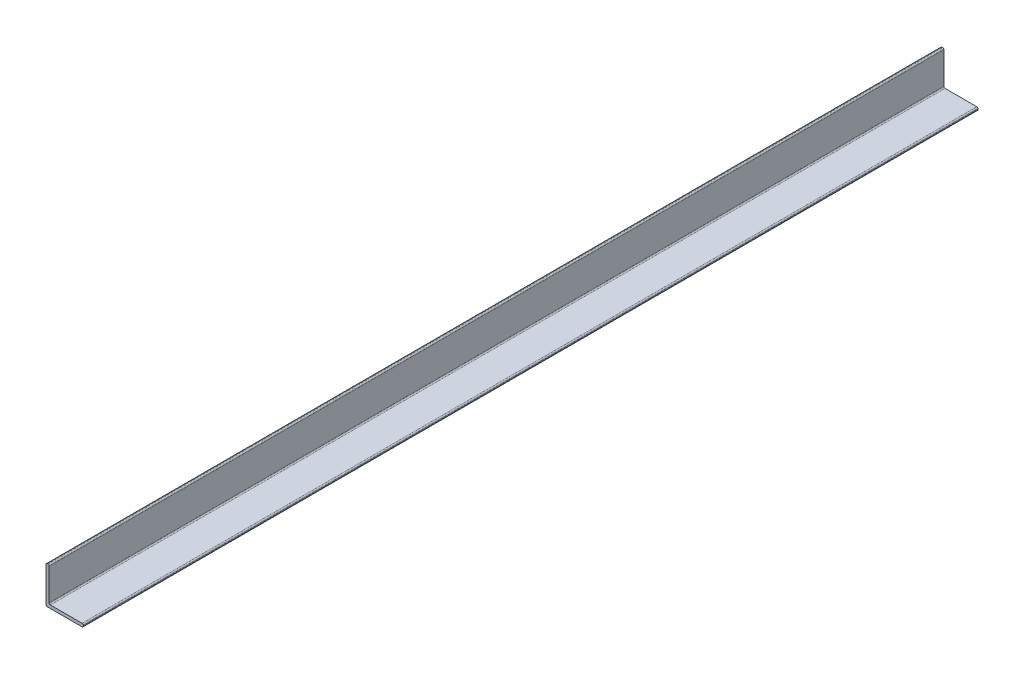
ISO-10303-21;
HEADER;
FILE_DESCRIPTION(('STEP AP214'),'2;1');
FILE_NAME('part.step','',(''),(''),'','','');
FILE_SCHEMA(('AUTOMOTIVE_DESIGN { 1 0 10303 214 1 1 1 1 }'));
ENDSEC;
DATA;
#1=APPLICATION_CONTEXT('core data for automotive mechanical design processes');
#2=APPLICATION_PROTOCOL_DEFINITION('international standard','automotive_design',2000,#1);
#3=PRODUCT_CONTEXT('',#1,'mechanical');
#4=PRODUCT('Part','Part','',(#3));
#5=PRODUCT_RELATED_PRODUCT_CATEGORY('part','',(#4));
#6=PRODUCT_DEFINITION_FORMATION('','',#4);
#7=PRODUCT_DEFINITION_CONTEXT('part definition',#1,'design');
#8=PRODUCT_DEFINITION('design','',#6,#7);
#9=PRODUCT_DEFINITION_SHAPE('','',#8);
#10=(LENGTH_UNIT() NAMED_UNIT(*) SI_UNIT(.MILLI.,.METRE.));
#11=(NAMED_UNIT(*) PLANE_ANGLE_UNIT() SI_UNIT($,.RADIAN.));
#12=(NAMED_UNIT(*) SI_UNIT($,.STERADIAN.) SOLID_ANGLE_UNIT());
#13=UNCERTAINTY_MEASURE_WITH_UNIT(LENGTH_MEASURE(1.E-05),#10,'distance_accuracy_value','');
#14=(GEOMETRIC_REPRESENTATION_CONTEXT(3) GLOBAL_UNCERTAINTY_ASSIGNED_CONTEXT((#13)) GLOBAL_UNIT_ASSIGNED_CONTEXT((#10,
#11,#12)) REPRESENTATION_CONTEXT('',''));
#15=CARTESIAN_POINT('',(0.,0.,0.));
#16=DIRECTION('',(0.,0.,1.));
#17=DIRECTION('',(1.,0.,0.));
#18=AXIS2_PLACEMENT_3D('',#15,#16,#17);
#19=CARTESIAN_POINT('',(-31.75,38.1,-914.4));
#20=DIRECTION('',(0.,1.,0.));
#21=DIRECTION('',(-1.,0.,0.));
#22=AXIS2_PLACEMENT_3D('',#19,#20,#21);
#23=PLANE('',#22);
#24=DIRECTION('',(-1.,0.,0.));
#25=VECTOR('',#24,1.);
#26=CARTESIAN_POINT('',(-31.75,38.1,-914.4));
#27=LINE('',#26,#25);
#28=CARTESIAN_POINT('',(-34.29,38.1,-914.4));
#29=VERTEX_POINT('',#28);
#30=CARTESIAN_POINT('',(-35.56,38.1,-914.4));
#31=VERTEX_POINT('',#30);
#32=EDGE_CURVE('E169',#29,#31,#27,.T.);
#33=ORIENTED_EDGE('',*,*,#32,.T.);
#34=DIRECTION('',(0.,0.,1.));
#35=VECTOR('',#34,1.);
#36=CARTESIAN_POINT('',(-35.56,38.1,-914.4));
#37=LINE('',#36,#35);
#38=CARTESIAN_POINT('',(-35.56,38.1,914.4));
#39=VERTEX_POINT('',#38);
#40=EDGE_CURVE('E54',#31,#39,#37,.T.);
#41=ORIENTED_EDGE('',*,*,#40,.T.);
#42=DIRECTION('',(-1.,0.,0.));
#43=VECTOR('',#42,1.);
#44=CARTESIAN_POINT('',(-31.75,38.1,914.4));
#45=LINE('',#44,#43);
#46=CARTESIAN_POINT('',(-34.29,38.1,914.4));
#47=VERTEX_POINT('',#46);
#48=EDGE_CURVE('E257',#47,#39,#45,.T.);
#49=ORIENTED_EDGE('',*,*,#48,.F.);
#50=DIRECTION('',(0.,0.,1.));
#51=VECTOR('',#50,1.);
#52=CARTESIAN_POINT('',(-34.29,38.1,-914.4));
#53=LINE('',#52,#51);
#54=EDGE_CURVE('E248',#47,#29,#53,.F.);
#55=ORIENTED_EDGE('',*,*,#54,.T.);
#56=EDGE_LOOP('',(#33,#41,#49,#55));
#57=FACE_BOUND('',#56,.T.);
#58=ADVANCED_FACE('F45',(#57),#23,.T.);
#59=CARTESIAN_POINT('',(-31.75,-29.21,-914.4));
#60=DIRECTION('',(1.,0.,0.));
#61=DIRECTION('',(0.,1.,0.));
#62=AXIS2_PLACEMENT_3D('',#59,#60,#61);
#63=PLANE('',#62);
#64=DIRECTION('',(0.,1.,0.));
#65=VECTOR('',#64,1.);
#66=CARTESIAN_POINT('',(-31.75,-29.21,-914.4));
#67=LINE('',#66,#65);
#68=CARTESIAN_POINT('',(-31.75,-29.21,-914.4));
#69=VERTEX_POINT('',#68);
#70=CARTESIAN_POINT('',(-31.75,35.56,-914.4));
#71=VERTEX_POINT('',#70);
#72=EDGE_CURVE('E161',#69,#71,#67,.T.);
#73=ORIENTED_EDGE('',*,*,#72,.T.);
#74=DIRECTION('',(0.,0.,1.));
#75=VECTOR('',#74,1.);
#76=CARTESIAN_POINT('',(-31.75,35.56,-914.4));
#77=LINE('',#76,#75);
#78=CARTESIAN_POINT('',(-31.75,35.56,914.4));
#79=VERTEX_POINT('',#78);
#80=EDGE_CURVE('E11',#71,#79,#77,.T.);
#81=ORIENTED_EDGE('',*,*,#80,.T.);
#82=DIRECTION('',(0.,1.,0.));
#83=VECTOR('',#82,1.);
#84=CARTESIAN_POINT('',(-31.75,-29.21,914.4));
#85=LINE('',#84,#83);
#86=CARTESIAN_POINT('',(-31.75,-29.21,914.4));
#87=VERTEX_POINT('',#86);
#88=EDGE_CURVE('E165',#87,#79,#85,.T.);
#89=ORIENTED_EDGE('',*,*,#88,.F.);
#90=DIRECTION('',(0.,0.,1.));
#91=VECTOR('',#90,1.);
#92=CARTESIAN_POINT('',(-31.75,-29.21,-914.4));
#93=LINE('',#92,#91);
#94=EDGE_CURVE('E160',#69,#87,#93,.T.);
#95=ORIENTED_EDGE('',*,*,#94,.F.);
#96=EDGE_LOOP('',(#73,#81,#89,#95));
#97=FACE_BOUND('',#96,.T.);
#98=ADVANCED_FACE('F301',(#97),#63,.T.);
#99=CARTESIAN_POINT('',(-29.21,-29.21,-914.4));
#100=DIRECTION('',(0.,0.,1.));
#101=DIRECTION('',(1.,0.,0.));
#102=AXIS2_PLACEMENT_3D('',#99,#100,#101);
#103=CYLINDRICAL_SURFACE('',#102,2.54);
#104=ORIENTED_EDGE('',*,*,#94,.T.);
#105=CARTESIAN_POINT('',(-29.21,-29.21,914.4));
#106=DIRECTION('',(0.,0.,-1.));
#107=DIRECTION('',(1.,0.,0.));
#108=AXIS2_PLACEMENT_3D('',#105,#106,#107);
#109=CIRCLE('',#108,2.54);
#110=CARTESIAN_POINT('',(-29.21,-31.75,914.4));
#111=VERTEX_POINT('',#110);
#112=EDGE_CURVE('E143',#111,#87,#109,.T.);
#113=ORIENTED_EDGE('',*,*,#112,.F.);
#114=DIRECTION('',(0.,0.,1.));
#115=VECTOR('',#114,1.);
#116=CARTESIAN_POINT('',(-29.21,-31.75,-914.4));
#117=LINE('',#116,#115);
#118=CARTESIAN_POINT('',(-29.21,-31.75,-914.4));
#119=VERTEX_POINT('',#118);
#120=EDGE_CURVE('E153',#119,#111,#117,.T.);
#121=ORIENTED_EDGE('',*,*,#120,.F.);
#122=CARTESIAN_POINT('',(-29.21,-29.21,-914.4));
#123=DIRECTION('',(0.,0.,-1.));
#124=DIRECTION('',(1.,0.,0.));
#125=AXIS2_PLACEMENT_3D('',#122,#123,#124);
#126=CIRCLE('',#125,2.54);
#127=EDGE_CURVE('E189',#119,#69,#126,.T.);
#128=ORIENTED_EDGE('',*,*,#127,.T.);
#129=EDGE_LOOP('',(#104,#113,#121,#128));
#130=FACE_BOUND('',#129,.T.);
#131=ADVANCED_FACE('F163',(#130),#103,.F.);
#132=CARTESIAN_POINT('',(38.1,-31.75,-914.4));
#133=DIRECTION('',(0.,1.,0.));
#134=DIRECTION('',(0.,0.,1.));
#135=AXIS2_PLACEMENT_3D('',#132,#133,#134);
#136=PLANE('',#135);
#137=DIRECTION('',(-1.,0.,0.));
#138=VECTOR('',#137,1.);
#139=CARTESIAN_POINT('',(38.1,-31.75,914.4));
#140=LINE('',#139,#138);
#141=CARTESIAN_POINT('',(35.56,-31.75,914.4));
#142=VERTEX_POINT('',#141);
#143=EDGE_CURVE('E137',#142,#111,#140,.T.);
#144=ORIENTED_EDGE('',*,*,#143,.F.);
#145=DIRECTION('',(0.,0.,1.));
#146=VECTOR('',#145,1.);
#147=CARTESIAN_POINT('',(35.56,-31.75,-914.4));
#148=LINE('',#147,#146);
#149=CARTESIAN_POINT('',(35.56,-31.75,-914.4));
#150=VERTEX_POINT('',#149);
#151=EDGE_CURVE('E245',#142,#150,#148,.F.);
#152=ORIENTED_EDGE('',*,*,#151,.T.);
#153=DIRECTION('',(-1.,0.,0.));
#154=VECTOR('',#153,1.);
#155=CARTESIAN_POINT('',(38.1,-31.75,-914.4));
#156=LINE('',#155,#154);
#157=EDGE_CURVE('E155',#150,#119,#156,.T.);
#158=ORIENTED_EDGE('',*,*,#157,.T.);
#159=ORIENTED_EDGE('',*,*,#120,.T.);
#160=EDGE_LOOP('',(#144,#152,#158,#159));
#161=FACE_BOUND('',#160,.T.);
#162=ADVANCED_FACE('F154',(#161),#136,.T.);
#163=CARTESIAN_POINT('',(38.1,-38.1,-914.4));
#164=DIRECTION('',(1.,0.,0.));
#165=DIRECTION('',(0.,1.,0.));
#166=AXIS2_PLACEMENT_3D('',#163,#164,#165);
#167=PLANE('',#166);
#168=DIRECTION('',(0.,1.,0.));
#169=VECTOR('',#168,1.);
#170=CARTESIAN_POINT('',(38.1,-38.1,914.4));
#171=LINE('',#170,#169);
#172=CARTESIAN_POINT('',(38.1,-35.56,914.4));
#173=VERTEX_POINT('',#172);
#174=CARTESIAN_POINT('',(38.1,-34.29,914.4));
#175=VERTEX_POINT('',#174);
#176=EDGE_CURVE('E150',#173,#175,#171,.T.);
#177=ORIENTED_EDGE('',*,*,#176,.F.);
#178=DIRECTION('',(0.,0.,1.));
#179=VECTOR('',#178,1.);
#180=CARTESIAN_POINT('',(38.1,-35.56,-914.4));
#181=LINE('',#180,#179);
#182=CARTESIAN_POINT('',(38.1,-35.56,-914.4));
#183=VERTEX_POINT('',#182);
#184=EDGE_CURVE('E68',#173,#183,#181,.F.);
#185=ORIENTED_EDGE('',*,*,#184,.T.);
#186=DIRECTION('',(0.,1.,0.));
#187=VECTOR('',#186,1.);
#188=CARTESIAN_POINT('',(38.1,-38.1,-914.4));
#189=LINE('',#188,#187);
#190=CARTESIAN_POINT('',(38.1,-34.29,-914.4));
#191=VERTEX_POINT('',#190);
#192=EDGE_CURVE('E184',#183,#191,#189,.T.);
#193=ORIENTED_EDGE('',*,*,#192,.T.);
#194=DIRECTION('',(0.,0.,1.));
#195=VECTOR('',#194,1.);
#196=CARTESIAN_POINT('',(38.1,-34.29,-914.4));
#197=LINE('',#196,#195);
#198=EDGE_CURVE('E239',#191,#175,#197,.T.);
#199=ORIENTED_EDGE('',*,*,#198,.T.);
#200=EDGE_LOOP('',(#177,#185,#193,#199));
#201=FACE_BOUND('',#200,.T.);
#202=ADVANCED_FACE('F275',(#201),#167,.T.);
#203=CARTESIAN_POINT('',(-38.1,-38.1,-914.4));
#204=DIRECTION('',(0.,-1.,0.));
#205=DIRECTION('',(0.,0.,-1.));
#206=AXIS2_PLACEMENT_3D('',#203,#204,#205);
#207=PLANE('',#206);
#208=DIRECTION('',(1.,0.,0.));
#209=VECTOR('',#208,1.);
#210=CARTESIAN_POINT('',(-38.1,-38.1,914.4));
#211=LINE('',#210,#209);
#212=CARTESIAN_POINT('',(-35.56,-38.1,914.4));
#213=VERTEX_POINT('',#212);
#214=CARTESIAN_POINT('',(35.56,-38.1,914.4));
#215=VERTEX_POINT('',#214);
#216=EDGE_CURVE('E268',#213,#215,#211,.T.);
#217=ORIENTED_EDGE('',*,*,#216,.F.);
#218=DIRECTION('',(0.,0.,1.));
#219=VECTOR('',#218,1.);
#220=CARTESIAN_POINT('',(-35.56,-38.1,-914.4));
#221=LINE('',#220,#219);
#222=CARTESIAN_POINT('',(-35.56,-38.1,-914.4));
#223=VERTEX_POINT('',#222);
#224=EDGE_CURVE('E222',#213,#223,#221,.F.);
#225=ORIENTED_EDGE('',*,*,#224,.T.);
#226=DIRECTION('',(1.,0.,0.));
#227=VECTOR('',#226,1.);
#228=CARTESIAN_POINT('',(-38.1,-38.1,-914.4));
#229=LINE('',#228,#227);
#230=CARTESIAN_POINT('',(35.56,-38.1,-914.4));
#231=VERTEX_POINT('',#230);
#232=EDGE_CURVE('E180',#223,#231,#229,.T.);
#233=ORIENTED_EDGE('',*,*,#232,.T.);
#234=DIRECTION('',(0.,0.,1.));
#235=VECTOR('',#234,1.);
#236=CARTESIAN_POINT('',(35.56,-38.1,-914.4));
#237=LINE('',#236,#235);
#238=EDGE_CURVE('E218',#231,#215,#237,.T.);
#239=ORIENTED_EDGE('',*,*,#238,.T.);
#240=EDGE_LOOP('',(#217,#225,#233,#239));
#241=FACE_BOUND('',#240,.T.);
#242=ADVANCED_FACE('F286',(#241),#207,.T.);
#243=CARTESIAN_POINT('',(-38.1,38.1,-914.4));
#244=DIRECTION('',(-1.,0.,0.));
#245=DIRECTION('',(0.,-1.,0.));
#246=AXIS2_PLACEMENT_3D('',#243,#244,#245);
#247=PLANE('',#246);
#248=DIRECTION('',(0.,-1.,0.));
#249=VECTOR('',#248,1.);
#250=CARTESIAN_POINT('',(-38.1,38.1,-914.4));
#251=LINE('',#250,#249);
#252=CARTESIAN_POINT('',(-38.1,35.56,-914.4));
#253=VERTEX_POINT('',#252);
#254=CARTESIAN_POINT('',(-38.1,-35.56,-914.4));
#255=VERTEX_POINT('',#254);
#256=EDGE_CURVE('E176',#253,#255,#251,.T.);
#257=ORIENTED_EDGE('',*,*,#256,.T.);
#258=DIRECTION('',(0.,0.,1.));
#259=VECTOR('',#258,1.);
#260=CARTESIAN_POINT('',(-38.1,-35.56,-914.4));
#261=LINE('',#260,#259);
#262=CARTESIAN_POINT('',(-38.1,-35.56,914.4));
#263=VERTEX_POINT('',#262);
#264=EDGE_CURVE('E200',#255,#263,#261,.T.);
#265=ORIENTED_EDGE('',*,*,#264,.T.);
#266=DIRECTION('',(0.,-1.,0.));
#267=VECTOR('',#266,1.);
#268=CARTESIAN_POINT('',(-38.1,38.1,914.4));
#269=LINE('',#268,#267);
#270=CARTESIAN_POINT('',(-38.1,35.56,914.4));
#271=VERTEX_POINT('',#270);
#272=EDGE_CURVE('E264',#271,#263,#269,.T.);
#273=ORIENTED_EDGE('',*,*,#272,.F.);
#274=DIRECTION('',(0.,0.,1.));
#275=VECTOR('',#274,1.);
#276=CARTESIAN_POINT('',(-38.1,35.56,-914.4));
#277=LINE('',#276,#275);
#278=EDGE_CURVE('E196',#271,#253,#277,.F.);
#279=ORIENTED_EDGE('',*,*,#278,.T.);
#280=EDGE_LOOP('',(#257,#265,#273,#279));
#281=FACE_BOUND('',#280,.T.);
#282=ADVANCED_FACE('F293',(#281),#247,.T.);
#283=CARTESIAN_POINT('',(-29.21,-29.21,-914.4));
#284=DIRECTION('',(0.,0.,1.));
#285=DIRECTION('',(1.,0.,0.));
#286=AXIS2_PLACEMENT_3D('',#283,#284,#285);
#287=PLANE('',#286);
#288=ORIENTED_EDGE('',*,*,#232,.F.);
#289=CARTESIAN_POINT('',(-35.56,-35.56,-914.4));
#290=DIRECTION('',(0.,0.,1.));
#291=DIRECTION('',(1.,0.,0.));
#292=AXIS2_PLACEMENT_3D('',#289,#290,#291);
#293=CIRCLE('',#292,2.54);
#294=EDGE_CURVE('E236',#223,#255,#293,.F.);
#295=ORIENTED_EDGE('',*,*,#294,.T.);
#296=ORIENTED_EDGE('',*,*,#256,.F.);
#297=CARTESIAN_POINT('',(-35.56,35.56,-914.4));
#298=DIRECTION('',(0.,0.,1.));
#299=DIRECTION('',(1.,0.,0.));
#300=AXIS2_PLACEMENT_3D('',#297,#298,#299);
#301=CIRCLE('',#300,2.54);
#302=EDGE_CURVE('E228',#253,#31,#301,.F.);
#303=ORIENTED_EDGE('',*,*,#302,.T.);
#304=ORIENTED_EDGE('',*,*,#32,.F.);
#305=CARTESIAN_POINT('',(-34.29,35.56,-914.4));
#306=DIRECTION('',(0.,0.,1.));
#307=DIRECTION('',(1.,0.,0.));
#308=AXIS2_PLACEMENT_3D('',#305,#306,#307);
#309=CIRCLE('',#308,2.54);
#310=EDGE_CURVE('E225',#29,#71,#309,.F.);
#311=ORIENTED_EDGE('',*,*,#310,.T.);
#312=ORIENTED_EDGE('',*,*,#72,.F.);
#313=ORIENTED_EDGE('',*,*,#127,.F.);
#314=ORIENTED_EDGE('',*,*,#157,.F.);
#315=CARTESIAN_POINT('',(35.56,-34.29,-914.4));
#316=DIRECTION('',(0.,0.,1.));
#317=DIRECTION('',(1.,0.,0.));
#318=AXIS2_PLACEMENT_3D('',#315,#316,#317);
#319=CIRCLE('',#318,2.54);
#320=EDGE_CURVE('E61',#150,#191,#319,.F.);
#321=ORIENTED_EDGE('',*,*,#320,.T.);
#322=ORIENTED_EDGE('',*,*,#192,.F.);
#323=CARTESIAN_POINT('',(35.56,-35.56,-914.4));
#324=DIRECTION('',(0.,0.,1.));
#325=DIRECTION('',(1.,0.,0.));
#326=AXIS2_PLACEMENT_3D('',#323,#324,#325);
#327=CIRCLE('',#326,2.54);
#328=EDGE_CURVE('E233',#183,#231,#327,.F.);
#329=ORIENTED_EDGE('',*,*,#328,.T.);
#330=EDGE_LOOP('',(#288,#295,#296,#303,#304,#311,#312,#313,#314,#321,#322,#329));
#331=FACE_BOUND('',#330,.T.);
#332=ADVANCED_FACE('F282',(#331),#287,.F.);
#333=CARTESIAN_POINT('',(-29.21,-29.21,914.4));
#334=DIRECTION('',(0.,0.,1.));
#335=DIRECTION('',(1.,0.,0.));
#336=AXIS2_PLACEMENT_3D('',#333,#334,#335);
#337=PLANE('',#336);
#338=ORIENTED_EDGE('',*,*,#272,.T.);
#339=CARTESIAN_POINT('',(-35.56,-35.56,914.4));
#340=DIRECTION('',(0.,0.,1.));
#341=DIRECTION('',(1.,0.,0.));
#342=AXIS2_PLACEMENT_3D('',#339,#340,#341);
#343=CIRCLE('',#342,2.54);
#344=EDGE_CURVE('E215',#263,#213,#343,.T.);
#345=ORIENTED_EDGE('',*,*,#344,.T.);
#346=ORIENTED_EDGE('',*,*,#216,.T.);
#347=CARTESIAN_POINT('',(35.56,-35.56,914.4));
#348=DIRECTION('',(0.,0.,1.));
#349=DIRECTION('',(1.,0.,0.));
#350=AXIS2_PLACEMENT_3D('',#347,#348,#349);
#351=CIRCLE('',#350,2.54);
#352=EDGE_CURVE('E212',#215,#173,#351,.T.);
#353=ORIENTED_EDGE('',*,*,#352,.T.);
#354=ORIENTED_EDGE('',*,*,#176,.T.);
#355=CARTESIAN_POINT('',(35.56,-34.29,914.4));
#356=DIRECTION('',(0.,0.,1.));
#357=DIRECTION('',(1.,0.,0.));
#358=AXIS2_PLACEMENT_3D('',#355,#356,#357);
#359=CIRCLE('',#358,2.54);
#360=EDGE_CURVE('E146',#175,#142,#359,.T.);
#361=ORIENTED_EDGE('',*,*,#360,.T.);
#362=ORIENTED_EDGE('',*,*,#143,.T.);
#363=ORIENTED_EDGE('',*,*,#112,.T.);
#364=ORIENTED_EDGE('',*,*,#88,.T.);
#365=CARTESIAN_POINT('',(-34.29,35.56,914.4));
#366=DIRECTION('',(0.,0.,1.));
#367=DIRECTION('',(1.,0.,0.));
#368=AXIS2_PLACEMENT_3D('',#365,#366,#367);
#369=CIRCLE('',#368,2.54);
#370=EDGE_CURVE('E204',#79,#47,#369,.T.);
#371=ORIENTED_EDGE('',*,*,#370,.T.);
#372=ORIENTED_EDGE('',*,*,#48,.T.);
#373=CARTESIAN_POINT('',(-35.56,35.56,914.4));
#374=DIRECTION('',(0.,0.,1.));
#375=DIRECTION('',(1.,0.,0.));
#376=AXIS2_PLACEMENT_3D('',#373,#374,#375);
#377=CIRCLE('',#376,2.54);
#378=EDGE_CURVE('E207',#39,#271,#377,.T.);
#379=ORIENTED_EDGE('',*,*,#378,.T.);
#380=EDGE_LOOP('',(#338,#345,#346,#353,#354,#361,#362,#363,#364,#371,#372,#379));
#381=FACE_BOUND('',#380,.T.);
#382=ADVANCED_FACE('F140',(#381),#337,.T.);
#383=CARTESIAN_POINT('',(-35.56,-35.56,-914.4));
#384=DIRECTION('',(0.,0.,1.));
#385=DIRECTION('',(1.,0.,0.));
#386=AXIS2_PLACEMENT_3D('',#383,#384,#385);
#387=CYLINDRICAL_SURFACE('',#386,2.54);
#388=ORIENTED_EDGE('',*,*,#294,.F.);
#389=ORIENTED_EDGE('',*,*,#224,.F.);
#390=ORIENTED_EDGE('',*,*,#344,.F.);
#391=ORIENTED_EDGE('',*,*,#264,.F.);
#392=EDGE_LOOP('',(#388,#389,#390,#391));
#393=FACE_BOUND('',#392,.T.);
#394=ADVANCED_FACE('F289',(#393),#387,.T.);
#395=CARTESIAN_POINT('',(35.56,-35.56,-914.4));
#396=DIRECTION('',(0.,0.,1.));
#397=DIRECTION('',(1.,0.,0.));
#398=AXIS2_PLACEMENT_3D('',#395,#396,#397);
#399=CYLINDRICAL_SURFACE('',#398,2.54);
#400=ORIENTED_EDGE('',*,*,#328,.F.);
#401=ORIENTED_EDGE('',*,*,#184,.F.);
#402=ORIENTED_EDGE('',*,*,#352,.F.);
#403=ORIENTED_EDGE('',*,*,#238,.F.);
#404=EDGE_LOOP('',(#400,#401,#402,#403));
#405=FACE_BOUND('',#404,.T.);
#406=ADVANCED_FACE('F279',(#405),#399,.T.);
#407=CARTESIAN_POINT('',(35.56,-34.29,-914.4));
#408=DIRECTION('',(0.,0.,1.));
#409=DIRECTION('',(1.,0.,0.));
#410=AXIS2_PLACEMENT_3D('',#407,#408,#409);
#411=CYLINDRICAL_SURFACE('',#410,2.54);
#412=ORIENTED_EDGE('',*,*,#320,.F.);
#413=ORIENTED_EDGE('',*,*,#151,.F.);
#414=ORIENTED_EDGE('',*,*,#360,.F.);
#415=ORIENTED_EDGE('',*,*,#198,.F.);
#416=EDGE_LOOP('',(#412,#413,#414,#415));
#417=FACE_BOUND('',#416,.T.);
#418=ADVANCED_FACE('F303',(#417),#411,.T.);
#419=CARTESIAN_POINT('',(-35.56,35.56,-914.4));
#420=DIRECTION('',(0.,0.,1.));
#421=DIRECTION('',(1.,0.,0.));
#422=AXIS2_PLACEMENT_3D('',#419,#420,#421);
#423=CYLINDRICAL_SURFACE('',#422,2.54);
#424=ORIENTED_EDGE('',*,*,#302,.F.);
#425=ORIENTED_EDGE('',*,*,#278,.F.);
#426=ORIENTED_EDGE('',*,*,#378,.F.);
#427=ORIENTED_EDGE('',*,*,#40,.F.);
#428=EDGE_LOOP('',(#424,#425,#426,#427));
#429=FACE_BOUND('',#428,.T.);
#430=ADVANCED_FACE('F295',(#429),#423,.T.);
#431=CARTESIAN_POINT('',(-34.29,35.56,-914.4));
#432=DIRECTION('',(0.,0.,1.));
#433=DIRECTION('',(1.,0.,0.));
#434=AXIS2_PLACEMENT_3D('',#431,#432,#433);
#435=CYLINDRICAL_SURFACE('',#434,2.54);
#436=ORIENTED_EDGE('',*,*,#310,.F.);
#437=ORIENTED_EDGE('',*,*,#54,.F.);
#438=ORIENTED_EDGE('',*,*,#370,.F.);
#439=ORIENTED_EDGE('',*,*,#80,.F.);
#440=EDGE_LOOP('',(#436,#437,#438,#439));
#441=FACE_BOUND('',#440,.T.);
#442=ADVANCED_FACE('F47',(#441),#435,.T.);
#443=CLOSED_SHELL('',(#58,#98,#131,#162,#202,#242,#282,#332,#382,#394,#406,#418,#430,#442));
#444=MANIFOLD_SOLID_BREP('B2',#443);
#445=ADVANCED_BREP_SHAPE_REPRESENTATION('',(#18,#444),#14);
#446=SHAPE_DEFINITION_REPRESENTATION(#9,#445);
ENDSEC;
END-ISO-10303-21;
